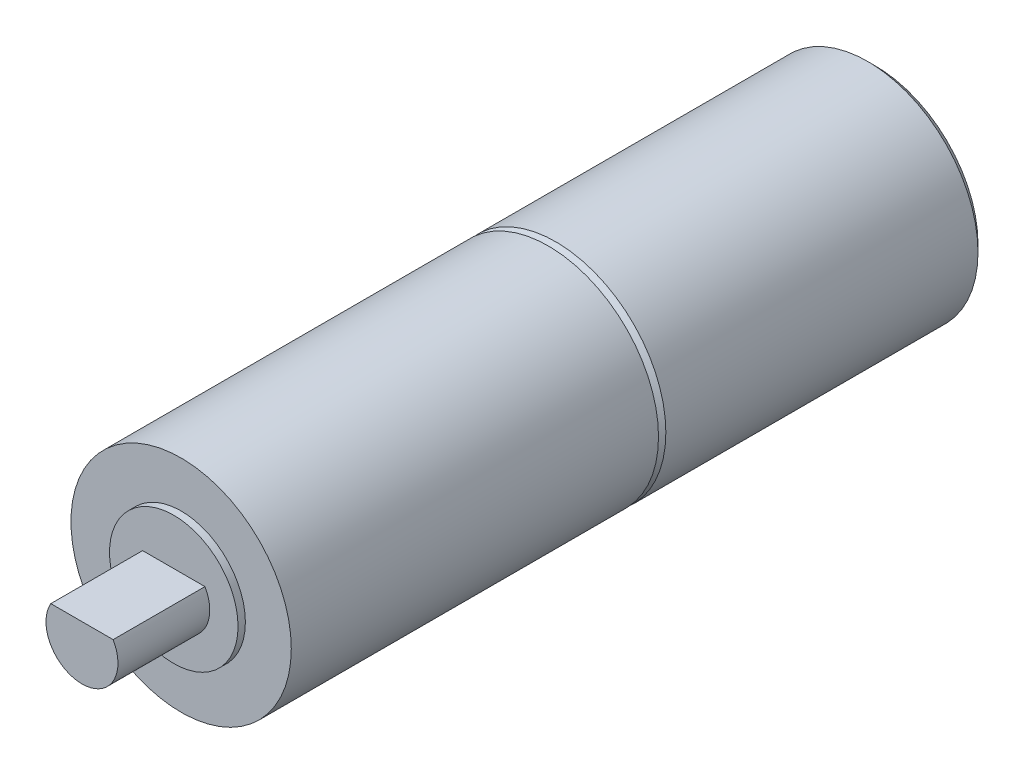
ISO-10303-21;
HEADER;
FILE_DESCRIPTION(('STEP AP214'),'2;1');
FILE_NAME('part.step','',(''),(''),'','','');
FILE_SCHEMA(('AUTOMOTIVE_DESIGN { 1 0 10303 214 1 1 1 1 }'));
ENDSEC;
DATA;
#1=APPLICATION_CONTEXT('core data for automotive mechanical design processes');
#2=APPLICATION_PROTOCOL_DEFINITION('international standard','automotive_design',2000,#1);
#3=PRODUCT_CONTEXT('',#1,'mechanical');
#4=PRODUCT('Part','Part','',(#3));
#5=PRODUCT_RELATED_PRODUCT_CATEGORY('part','',(#4));
#6=PRODUCT_DEFINITION_FORMATION('','',#4);
#7=PRODUCT_DEFINITION_CONTEXT('part definition',#1,'design');
#8=PRODUCT_DEFINITION('design','',#6,#7);
#9=PRODUCT_DEFINITION_SHAPE('','',#8);
#10=(LENGTH_UNIT() NAMED_UNIT(*) SI_UNIT(.MILLI.,.METRE.));
#11=(NAMED_UNIT(*) PLANE_ANGLE_UNIT() SI_UNIT($,.RADIAN.));
#12=(NAMED_UNIT(*) SI_UNIT($,.STERADIAN.) SOLID_ANGLE_UNIT());
#13=UNCERTAINTY_MEASURE_WITH_UNIT(LENGTH_MEASURE(1.E-05),#10,'distance_accuracy_value','');
#14=(GEOMETRIC_REPRESENTATION_CONTEXT(3) GLOBAL_UNCERTAINTY_ASSIGNED_CONTEXT((#13)) GLOBAL_UNIT_ASSIGNED_CONTEXT((#10,
#11,#12)) REPRESENTATION_CONTEXT('',''));
#15=CARTESIAN_POINT('',(0.,0.,0.));
#16=DIRECTION('',(0.,0.,1.));
#17=DIRECTION('',(1.,0.,0.));
#18=AXIS2_PLACEMENT_3D('',#15,#16,#17);
#19=CARTESIAN_POINT('',(0.,0.,19.1));
#20=DIRECTION('',(0.,0.,1.));
#21=DIRECTION('',(1.,0.,0.));
#22=AXIS2_PLACEMENT_3D('',#19,#20,#21);
#23=PLANE('',#22);
#24=CARTESIAN_POINT('',(0.,0.,19.1));
#25=DIRECTION('',(0.,0.,1.));
#26=DIRECTION('',(1.,0.,0.));
#27=AXIS2_PLACEMENT_3D('',#24,#25,#26);
#28=CIRCLE('',#27,1.75);
#29=CARTESIAN_POINT('',(1.75,0.,19.1));
#30=VERTEX_POINT('',#29);
#31=EDGE_CURVE('E80',#30,#30,#28,.T.);
#32=ORIENTED_EDGE('',*,*,#31,.T.);
#33=EDGE_LOOP('',(#32));
#34=FACE_BOUND('',#33,.T.);
#35=DIRECTION('',(-1.,0.,0.));
#36=VECTOR('',#35,1.);
#37=CARTESIAN_POINT('',(0.,0.49,19.1));
#38=LINE('',#37,#36);
#39=CARTESIAN_POINT('',(0.848704895708728,0.49,19.1));
#40=VERTEX_POINT('',#39);
#41=CARTESIAN_POINT('',(-0.848704895708728,0.49,19.1));
#42=VERTEX_POINT('',#41);
#43=EDGE_CURVE('E64',#40,#42,#38,.T.);
#44=ORIENTED_EDGE('',*,*,#43,.F.);
#45=CARTESIAN_POINT('',(0.,0.,19.1));
#46=DIRECTION('',(0.,0.,1.));
#47=DIRECTION('',(1.,0.,0.));
#48=AXIS2_PLACEMENT_3D('',#45,#46,#47);
#49=CIRCLE('',#48,0.979999999999981);
#50=EDGE_CURVE('E49',#42,#40,#49,.T.);
#51=ORIENTED_EDGE('',*,*,#50,.F.);
#52=EDGE_LOOP('',(#44,#51));
#53=FACE_BOUND('',#52,.T.);
#54=ADVANCED_FACE('F34',(#34,#53),#23,.T.);
#55=CARTESIAN_POINT('',(0.,0.,8.9));
#56=DIRECTION('',(0.,0.,-1.));
#57=DIRECTION('',(-1.,0.,0.));
#58=AXIS2_PLACEMENT_3D('',#55,#56,#57);
#59=CYLINDRICAL_SURFACE('',#58,3.);
#60=CARTESIAN_POINT('',(0.,0.,0.199999999999999));
#61=DIRECTION('',(0.,0.,1.));
#62=DIRECTION('',(1.,0.,0.));
#63=AXIS2_PLACEMENT_3D('',#60,#61,#62);
#64=CIRCLE('',#63,3.);
#65=CARTESIAN_POINT('',(3.,0.,0.199999999999999));
#66=VERTEX_POINT('',#65);
#67=EDGE_CURVE('E94',#66,#66,#64,.T.);
#68=ORIENTED_EDGE('',*,*,#67,.T.);
#69=EDGE_LOOP('',(#68));
#70=FACE_BOUND('',#69,.T.);
#71=CARTESIAN_POINT('',(0.,0.,8.7));
#72=DIRECTION('',(0.,0.,1.));
#73=DIRECTION('',(1.,0.,0.));
#74=AXIS2_PLACEMENT_3D('',#71,#72,#73);
#75=CIRCLE('',#74,3.);
#76=CARTESIAN_POINT('',(3.,0.,8.7));
#77=VERTEX_POINT('',#76);
#78=EDGE_CURVE('E89',#77,#77,#75,.F.);
#79=ORIENTED_EDGE('',*,*,#78,.T.);
#80=EDGE_LOOP('',(#79));
#81=FACE_BOUND('',#80,.T.);
#82=ADVANCED_FACE('F106',(#70,#81),#59,.T.);
#83=CARTESIAN_POINT('',(0.,0.,0.));
#84=DIRECTION('',(0.,0.,1.));
#85=DIRECTION('',(1.,0.,0.));
#86=AXIS2_PLACEMENT_3D('',#83,#84,#85);
#87=PLANE('',#86);
#88=CARTESIAN_POINT('',(0.,0.,0.));
#89=DIRECTION('',(0.,0.,1.));
#90=DIRECTION('',(1.,0.,0.));
#91=AXIS2_PLACEMENT_3D('',#88,#89,#90);
#92=CIRCLE('',#91,2.8);
#93=CARTESIAN_POINT('',(2.8,0.,0.));
#94=VERTEX_POINT('',#93);
#95=EDGE_CURVE('E42',#94,#94,#92,.F.);
#96=ORIENTED_EDGE('',*,*,#95,.T.);
#97=EDGE_LOOP('',(#96));
#98=FACE_BOUND('',#97,.T.);
#99=ADVANCED_FACE('F99',(#98),#87,.F.);
#100=CARTESIAN_POINT('',(0.,0.,0.199999999999999));
#101=DIRECTION('',(0.,0.,1.));
#102=DIRECTION('',(1.,0.,0.));
#103=AXIS2_PLACEMENT_3D('',#100,#101,#102);
#104=CONICAL_SURFACE('',#103,3.,0.785398163397449);
#105=ORIENTED_EDGE('',*,*,#95,.F.);
#106=EDGE_LOOP('',(#105));
#107=FACE_BOUND('',#106,.T.);
#108=ORIENTED_EDGE('',*,*,#67,.F.);
#109=EDGE_LOOP('',(#108));
#110=FACE_BOUND('',#109,.T.);
#111=ADVANCED_FACE('F101',(#107,#110),#104,.T.);
#112=CARTESIAN_POINT('',(0.,0.,8.9));
#113=DIRECTION('',(0.,0.,-1.));
#114=DIRECTION('',(-1.,0.,0.));
#115=AXIS2_PLACEMENT_3D('',#112,#113,#114);
#116=CONICAL_SURFACE('',#115,2.8,0.785398163397447);
#117=ORIENTED_EDGE('',*,*,#78,.F.);
#118=EDGE_LOOP('',(#117));
#119=FACE_BOUND('',#118,.T.);
#120=CARTESIAN_POINT('',(0.,0.,8.9));
#121=DIRECTION('',(0.,0.,1.));
#122=DIRECTION('',(1.,0.,0.));
#123=AXIS2_PLACEMENT_3D('',#120,#121,#122);
#124=CIRCLE('',#123,2.8);
#125=CARTESIAN_POINT('',(2.8,0.,8.9));
#126=VERTEX_POINT('',#125);
#127=EDGE_CURVE('E11',#126,#126,#124,.T.);
#128=ORIENTED_EDGE('',*,*,#127,.F.);
#129=EDGE_LOOP('',(#128));
#130=FACE_BOUND('',#129,.T.);
#131=ADVANCED_FACE('F36',(#119,#130),#116,.T.);
#132=CARTESIAN_POINT('',(0.,0.,18.9));
#133=DIRECTION('',(0.,0.,-1.));
#134=DIRECTION('',(-1.,0.,0.));
#135=AXIS2_PLACEMENT_3D('',#132,#133,#134);
#136=CYLINDRICAL_SURFACE('',#135,3.);
#137=CARTESIAN_POINT('',(0.,0.,18.9));
#138=DIRECTION('',(0.,0.,1.));
#139=DIRECTION('',(1.,0.,0.));
#140=AXIS2_PLACEMENT_3D('',#137,#138,#139);
#141=CIRCLE('',#140,3.);
#142=CARTESIAN_POINT('',(3.,0.,18.9));
#143=VERTEX_POINT('',#142);
#144=EDGE_CURVE('E86',#143,#143,#141,.T.);
#145=ORIENTED_EDGE('',*,*,#144,.F.);
#146=EDGE_LOOP('',(#145));
#147=FACE_BOUND('',#146,.T.);
#148=CARTESIAN_POINT('',(0.,0.,8.9));
#149=DIRECTION('',(0.,0.,1.));
#150=DIRECTION('',(1.,0.,0.));
#151=AXIS2_PLACEMENT_3D('',#148,#149,#150);
#152=CIRCLE('',#151,3.);
#153=CARTESIAN_POINT('',(3.,0.,8.9));
#154=VERTEX_POINT('',#153);
#155=EDGE_CURVE('E83',#154,#154,#152,.T.);
#156=ORIENTED_EDGE('',*,*,#155,.T.);
#157=EDGE_LOOP('',(#156));
#158=FACE_BOUND('',#157,.T.);
#159=ADVANCED_FACE('F114',(#147,#158),#136,.T.);
#160=CARTESIAN_POINT('',(0.,0.,18.9));
#161=DIRECTION('',(0.,0.,1.));
#162=DIRECTION('',(1.,0.,0.));
#163=AXIS2_PLACEMENT_3D('',#160,#161,#162);
#164=PLANE('',#163);
#165=CARTESIAN_POINT('',(0.,0.,18.9));
#166=DIRECTION('',(0.,0.,1.));
#167=DIRECTION('',(1.,0.,0.));
#168=AXIS2_PLACEMENT_3D('',#165,#166,#167);
#169=CIRCLE('',#168,1.75);
#170=CARTESIAN_POINT('',(1.75,0.,18.9));
#171=VERTEX_POINT('',#170);
#172=EDGE_CURVE('E79',#171,#171,#169,.T.);
#173=ORIENTED_EDGE('',*,*,#172,.F.);
#174=EDGE_LOOP('',(#173));
#175=FACE_BOUND('',#174,.T.);
#176=ORIENTED_EDGE('',*,*,#144,.T.);
#177=EDGE_LOOP('',(#176));
#178=FACE_BOUND('',#177,.T.);
#179=ADVANCED_FACE('F121',(#175,#178),#164,.T.);
#180=CARTESIAN_POINT('',(0.,0.,8.9));
#181=DIRECTION('',(0.,0.,1.));
#182=DIRECTION('',(1.,0.,0.));
#183=AXIS2_PLACEMENT_3D('',#180,#181,#182);
#184=PLANE('',#183);
#185=ORIENTED_EDGE('',*,*,#127,.T.);
#186=EDGE_LOOP('',(#185));
#187=FACE_BOUND('',#186,.T.);
#188=ORIENTED_EDGE('',*,*,#155,.F.);
#189=EDGE_LOOP('',(#188));
#190=FACE_BOUND('',#189,.T.);
#191=ADVANCED_FACE('F117',(#187,#190),#184,.F.);
#192=CARTESIAN_POINT('',(0.,0.,19.1));
#193=DIRECTION('',(0.,0.,-1.));
#194=DIRECTION('',(-1.,0.,0.));
#195=AXIS2_PLACEMENT_3D('',#192,#193,#194);
#196=CYLINDRICAL_SURFACE('',#195,1.75);
#197=ORIENTED_EDGE('',*,*,#31,.F.);
#198=EDGE_LOOP('',(#197));
#199=FACE_BOUND('',#198,.T.);
#200=ORIENTED_EDGE('',*,*,#172,.T.);
#201=EDGE_LOOP('',(#200));
#202=FACE_BOUND('',#201,.T.);
#203=ADVANCED_FACE('F120',(#199,#202),#196,.T.);
#204=CARTESIAN_POINT('',(0.,0.,21.6));
#205=DIRECTION('',(0.,0.,-1.));
#206=DIRECTION('',(-1.,0.,0.));
#207=AXIS2_PLACEMENT_3D('',#204,#205,#206);
#208=CYLINDRICAL_SURFACE('',#207,0.979999999999981);
#209=ORIENTED_EDGE('',*,*,#50,.T.);
#210=DIRECTION('',(0.,0.,-1.));
#211=VECTOR('',#210,1.);
#212=CARTESIAN_POINT('',(0.848704895708728,0.49,21.6));
#213=LINE('',#212,#211);
#214=CARTESIAN_POINT('',(0.848704895708728,0.49,21.6));
#215=VERTEX_POINT('',#214);
#216=EDGE_CURVE('E68',#215,#40,#213,.T.);
#217=ORIENTED_EDGE('',*,*,#216,.F.);
#218=CARTESIAN_POINT('',(0.,0.,21.6));
#219=DIRECTION('',(0.,0.,1.));
#220=DIRECTION('',(1.,0.,0.));
#221=AXIS2_PLACEMENT_3D('',#218,#219,#220);
#222=CIRCLE('',#221,0.979999999999981);
#223=CARTESIAN_POINT('',(-0.848704895708728,0.49,21.6));
#224=VERTEX_POINT('',#223);
#225=EDGE_CURVE('E70',#224,#215,#222,.T.);
#226=ORIENTED_EDGE('',*,*,#225,.F.);
#227=DIRECTION('',(0.,0.,-1.));
#228=VECTOR('',#227,1.);
#229=CARTESIAN_POINT('',(-0.848704895708728,0.49,21.6));
#230=LINE('',#229,#228);
#231=EDGE_CURVE('E66',#224,#42,#230,.T.);
#232=ORIENTED_EDGE('',*,*,#231,.T.);
#233=EDGE_LOOP('',(#209,#217,#226,#232));
#234=FACE_BOUND('',#233,.T.);
#235=ADVANCED_FACE('F72',(#234),#208,.T.);
#236=CARTESIAN_POINT('',(0.,0.49,21.6));
#237=DIRECTION('',(0.,-1.,0.));
#238=DIRECTION('',(0.,0.,-1.));
#239=AXIS2_PLACEMENT_3D('',#236,#237,#238);
#240=PLANE('',#239);
#241=ORIENTED_EDGE('',*,*,#43,.T.);
#242=ORIENTED_EDGE('',*,*,#231,.F.);
#243=DIRECTION('',(-1.,0.,0.));
#244=VECTOR('',#243,1.);
#245=CARTESIAN_POINT('',(0.,0.49,21.6));
#246=LINE('',#245,#244);
#247=EDGE_CURVE('E57',#215,#224,#246,.T.);
#248=ORIENTED_EDGE('',*,*,#247,.F.);
#249=ORIENTED_EDGE('',*,*,#216,.T.);
#250=EDGE_LOOP('',(#241,#242,#248,#249));
#251=FACE_BOUND('',#250,.T.);
#252=ADVANCED_FACE('F65',(#251),#240,.F.);
#253=CARTESIAN_POINT('',(0.,0.,21.6));
#254=DIRECTION('',(0.,0.,1.));
#255=DIRECTION('',(1.,0.,0.));
#256=AXIS2_PLACEMENT_3D('',#253,#254,#255);
#257=PLANE('',#256);
#258=ORIENTED_EDGE('',*,*,#225,.T.);
#259=ORIENTED_EDGE('',*,*,#247,.T.);
#260=EDGE_LOOP('',(#258,#259));
#261=FACE_BOUND('',#260,.T.);
#262=ADVANCED_FACE('F155',(#261),#257,.T.);
#263=CLOSED_SHELL('',(#54,#82,#99,#111,#131,#159,#179,#191,#203,#235,#252,#262));
#264=MANIFOLD_SOLID_BREP('B2',#263);
#265=ADVANCED_BREP_SHAPE_REPRESENTATION('',(#18,#264),#14);
#266=SHAPE_DEFINITION_REPRESENTATION(#9,#265);
ENDSEC;
END-ISO-10303-21;
